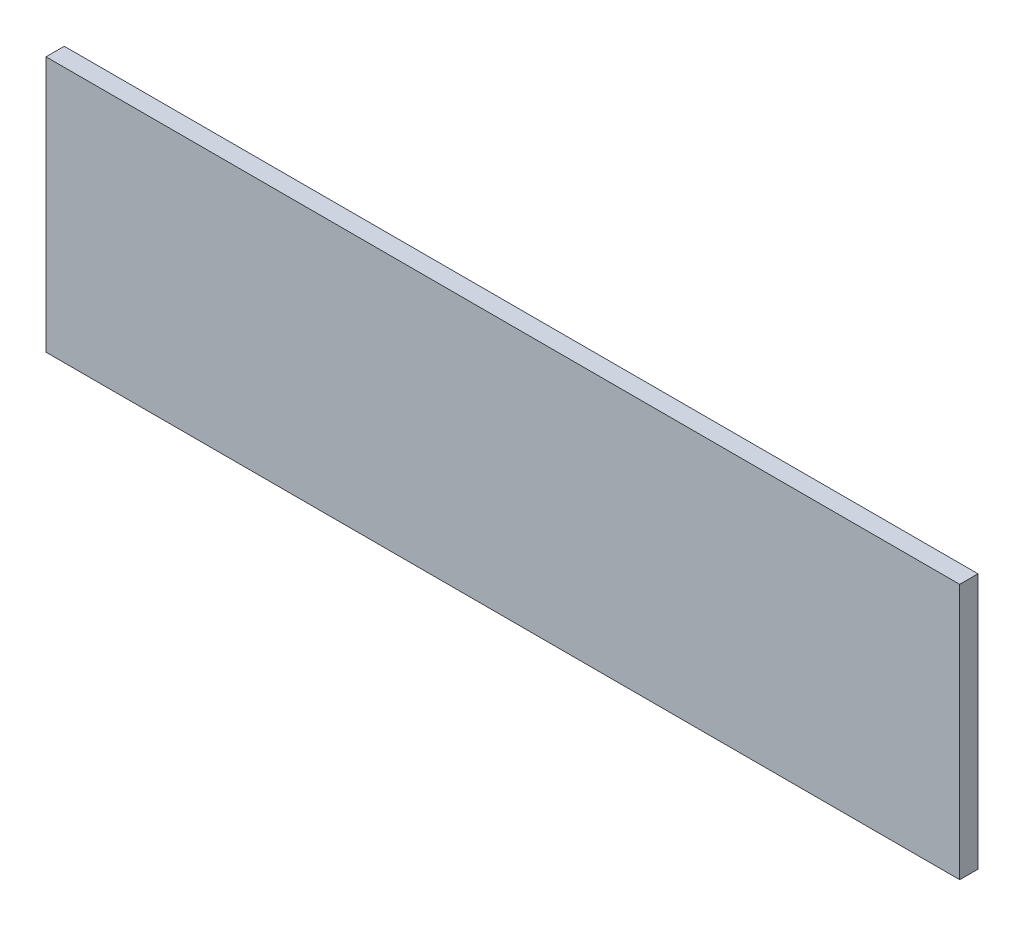
ISO-10303-21;
HEADER;
FILE_DESCRIPTION(('STEP AP214'),'2;1');
FILE_NAME('part.step','',(''),(''),'','','');
FILE_SCHEMA(('AUTOMOTIVE_DESIGN { 1 0 10303 214 1 1 1 1 }'));
ENDSEC;
DATA;
#1=APPLICATION_CONTEXT('core data for automotive mechanical design processes');
#2=APPLICATION_PROTOCOL_DEFINITION('international standard','automotive_design',2000,#1);
#3=PRODUCT_CONTEXT('',#1,'mechanical');
#4=PRODUCT('Part','Part','',(#3));
#5=PRODUCT_RELATED_PRODUCT_CATEGORY('part','',(#4));
#6=PRODUCT_DEFINITION_FORMATION('','',#4);
#7=PRODUCT_DEFINITION_CONTEXT('part definition',#1,'design');
#8=PRODUCT_DEFINITION('design','',#6,#7);
#9=PRODUCT_DEFINITION_SHAPE('','',#8);
#10=(LENGTH_UNIT() NAMED_UNIT(*) SI_UNIT(.MILLI.,.METRE.));
#11=(NAMED_UNIT(*) PLANE_ANGLE_UNIT() SI_UNIT($,.RADIAN.));
#12=(NAMED_UNIT(*) SI_UNIT($,.STERADIAN.) SOLID_ANGLE_UNIT());
#13=UNCERTAINTY_MEASURE_WITH_UNIT(LENGTH_MEASURE(1.E-05),#10,'distance_accuracy_value','');
#14=(GEOMETRIC_REPRESENTATION_CONTEXT(3) GLOBAL_UNCERTAINTY_ASSIGNED_CONTEXT((#13)) GLOBAL_UNIT_ASSIGNED_CONTEXT((#10,
#11,#12)) REPRESENTATION_CONTEXT('',''));
#15=CARTESIAN_POINT('',(0.,0.,0.));
#16=DIRECTION('',(0.,0.,1.));
#17=DIRECTION('',(1.,0.,0.));
#18=AXIS2_PLACEMENT_3D('',#15,#16,#17);
#19=CARTESIAN_POINT('',(0.,-2.25,0.12));
#20=DIRECTION('',(0.,0.,1.));
#21=DIRECTION('',(0.,-1.,0.));
#22=AXIS2_PLACEMENT_3D('',#19,#20,#21);
#23=PLANE('',#22);
#24=DIRECTION('',(0.,1.,0.));
#25=VECTOR('',#24,1.);
#26=CARTESIAN_POINT('',(-6.25,-2.25,0.12));
#27=LINE('',#26,#25);
#28=CARTESIAN_POINT('',(-6.25,-1.,0.12));
#29=VERTEX_POINT('',#28);
#30=CARTESIAN_POINT('',(-6.25,-4.5,0.12));
#31=VERTEX_POINT('',#30);
#32=EDGE_CURVE('E38',#29,#31,#27,.F.);
#33=ORIENTED_EDGE('',*,*,#32,.F.);
#34=DIRECTION('',(1.,0.,0.));
#35=VECTOR('',#34,1.);
#36=CARTESIAN_POINT('',(-6.251,-1.,0.12));
#37=LINE('',#36,#35);
#38=CARTESIAN_POINT('',(6.25,-1.,0.12));
#39=VERTEX_POINT('',#38);
#40=EDGE_CURVE('E83',#29,#39,#37,.T.);
#41=ORIENTED_EDGE('',*,*,#40,.T.);
#42=DIRECTION('',(0.,1.,0.));
#43=VECTOR('',#42,1.);
#44=CARTESIAN_POINT('',(6.25,-2.25,0.12));
#45=LINE('',#44,#43);
#46=CARTESIAN_POINT('',(6.25,-4.5,0.12));
#47=VERTEX_POINT('',#46);
#48=EDGE_CURVE('E99',#47,#39,#45,.T.);
#49=ORIENTED_EDGE('',*,*,#48,.F.);
#50=DIRECTION('',(1.,0.,0.));
#51=VECTOR('',#50,1.);
#52=CARTESIAN_POINT('',(0.,-4.5,0.12));
#53=LINE('',#52,#51);
#54=EDGE_CURVE('E93',#31,#47,#53,.T.);
#55=ORIENTED_EDGE('',*,*,#54,.F.);
#56=EDGE_LOOP('',(#33,#41,#49,#55));
#57=FACE_BOUND('',#56,.T.);
#58=ADVANCED_FACE('F35',(#57),#23,.F.);
#59=CARTESIAN_POINT('',(-6.25,-2.25,0.12));
#60=DIRECTION('',(-1.,0.,0.));
#61=DIRECTION('',(0.,0.,1.));
#62=AXIS2_PLACEMENT_3D('',#59,#60,#61);
#63=PLANE('',#62);
#64=DIRECTION('',(0.,0.,-1.));
#65=VECTOR('',#64,1.);
#66=CARTESIAN_POINT('',(-6.25,-1.,0.12));
#67=LINE('',#66,#65);
#68=CARTESIAN_POINT('',(-6.25,-1.,0.37));
#69=VERTEX_POINT('',#68);
#70=EDGE_CURVE('E51',#69,#29,#67,.T.);
#71=ORIENTED_EDGE('',*,*,#70,.T.);
#72=ORIENTED_EDGE('',*,*,#32,.T.);
#73=DIRECTION('',(0.,0.,-1.));
#74=VECTOR('',#73,1.);
#75=CARTESIAN_POINT('',(-6.25,-4.5,0.12));
#76=LINE('',#75,#74);
#77=CARTESIAN_POINT('',(-6.25,-4.5,0.37));
#78=VERTEX_POINT('',#77);
#79=EDGE_CURVE('E95',#78,#31,#76,.T.);
#80=ORIENTED_EDGE('',*,*,#79,.F.);
#81=DIRECTION('',(0.,-1.,0.));
#82=VECTOR('',#81,1.);
#83=CARTESIAN_POINT('',(-6.25,-2.25,0.37));
#84=LINE('',#83,#82);
#85=EDGE_CURVE('E91',#69,#78,#84,.T.);
#86=ORIENTED_EDGE('',*,*,#85,.F.);
#87=EDGE_LOOP('',(#71,#72,#80,#86));
#88=FACE_BOUND('',#87,.T.);
#89=ADVANCED_FACE('F90',(#88),#63,.T.);
#90=CARTESIAN_POINT('',(0.,-4.5,0.12));
#91=DIRECTION('',(0.,-1.,0.));
#92=DIRECTION('',(0.,0.,-1.));
#93=AXIS2_PLACEMENT_3D('',#90,#91,#92);
#94=PLANE('',#93);
#95=ORIENTED_EDGE('',*,*,#54,.T.);
#96=DIRECTION('',(0.,0.,-1.));
#97=VECTOR('',#96,1.);
#98=CARTESIAN_POINT('',(6.25,-4.5,0.12));
#99=LINE('',#98,#97);
#100=CARTESIAN_POINT('',(6.25,-4.5,0.37));
#101=VERTEX_POINT('',#100);
#102=EDGE_CURVE('E60',#101,#47,#99,.T.);
#103=ORIENTED_EDGE('',*,*,#102,.F.);
#104=DIRECTION('',(1.,0.,0.));
#105=VECTOR('',#104,1.);
#106=CARTESIAN_POINT('',(0.,-4.5,0.37));
#107=LINE('',#106,#105);
#108=EDGE_CURVE('E43',#78,#101,#107,.T.);
#109=ORIENTED_EDGE('',*,*,#108,.F.);
#110=ORIENTED_EDGE('',*,*,#79,.T.);
#111=EDGE_LOOP('',(#95,#103,#109,#110));
#112=FACE_BOUND('',#111,.T.);
#113=ADVANCED_FACE('F107',(#112),#94,.T.);
#114=CARTESIAN_POINT('',(6.25,-2.25,0.12));
#115=DIRECTION('',(1.,0.,0.));
#116=DIRECTION('',(0.,0.,-1.));
#117=AXIS2_PLACEMENT_3D('',#114,#115,#116);
#118=PLANE('',#117);
#119=DIRECTION('',(0.,0.,-1.));
#120=VECTOR('',#119,1.);
#121=CARTESIAN_POINT('',(6.25,-1.,0.12));
#122=LINE('',#121,#120);
#123=CARTESIAN_POINT('',(6.25,-1.,0.37));
#124=VERTEX_POINT('',#123);
#125=EDGE_CURVE('E78',#124,#39,#122,.T.);
#126=ORIENTED_EDGE('',*,*,#125,.F.);
#127=DIRECTION('',(0.,-1.,0.));
#128=VECTOR('',#127,1.);
#129=CARTESIAN_POINT('',(6.25,-2.25,0.37));
#130=LINE('',#129,#128);
#131=EDGE_CURVE('E11',#101,#124,#130,.F.);
#132=ORIENTED_EDGE('',*,*,#131,.F.);
#133=ORIENTED_EDGE('',*,*,#102,.T.);
#134=ORIENTED_EDGE('',*,*,#48,.T.);
#135=EDGE_LOOP('',(#126,#132,#133,#134));
#136=FACE_BOUND('',#135,.T.);
#137=ADVANCED_FACE('F109',(#136),#118,.T.);
#138=CARTESIAN_POINT('',(0.,-2.25,0.37));
#139=DIRECTION('',(0.,0.,1.));
#140=DIRECTION('',(0.,-1.,0.));
#141=AXIS2_PLACEMENT_3D('',#138,#139,#140);
#142=PLANE('',#141);
#143=DIRECTION('',(1.,0.,0.));
#144=VECTOR('',#143,1.);
#145=CARTESIAN_POINT('',(-6.251,-1.,0.37));
#146=LINE('',#145,#144);
#147=EDGE_CURVE('E81',#69,#124,#146,.T.);
#148=ORIENTED_EDGE('',*,*,#147,.F.);
#149=ORIENTED_EDGE('',*,*,#85,.T.);
#150=ORIENTED_EDGE('',*,*,#108,.T.);
#151=ORIENTED_EDGE('',*,*,#131,.T.);
#152=EDGE_LOOP('',(#148,#149,#150,#151));
#153=FACE_BOUND('',#152,.T.);
#154=ADVANCED_FACE('F106',(#153),#142,.T.);
#155=CARTESIAN_POINT('',(-6.251,-1.,0.12));
#156=DIRECTION('',(0.,-1.,0.));
#157=DIRECTION('',(0.,0.,-1.));
#158=AXIS2_PLACEMENT_3D('',#155,#156,#157);
#159=PLANE('',#158);
#160=ORIENTED_EDGE('',*,*,#147,.T.);
#161=ORIENTED_EDGE('',*,*,#125,.T.);
#162=ORIENTED_EDGE('',*,*,#40,.F.);
#163=ORIENTED_EDGE('',*,*,#70,.F.);
#164=EDGE_LOOP('',(#160,#161,#162,#163));
#165=FACE_BOUND('',#164,.T.);
#166=ADVANCED_FACE('F84',(#165),#159,.F.);
#167=CLOSED_SHELL('',(#58,#89,#113,#137,#154,#166));
#168=MANIFOLD_SOLID_BREP('B2',#167);
#169=ADVANCED_BREP_SHAPE_REPRESENTATION('',(#18,#168),#14);
#170=SHAPE_DEFINITION_REPRESENTATION(#9,#169);
ENDSEC;
END-ISO-10303-21;
